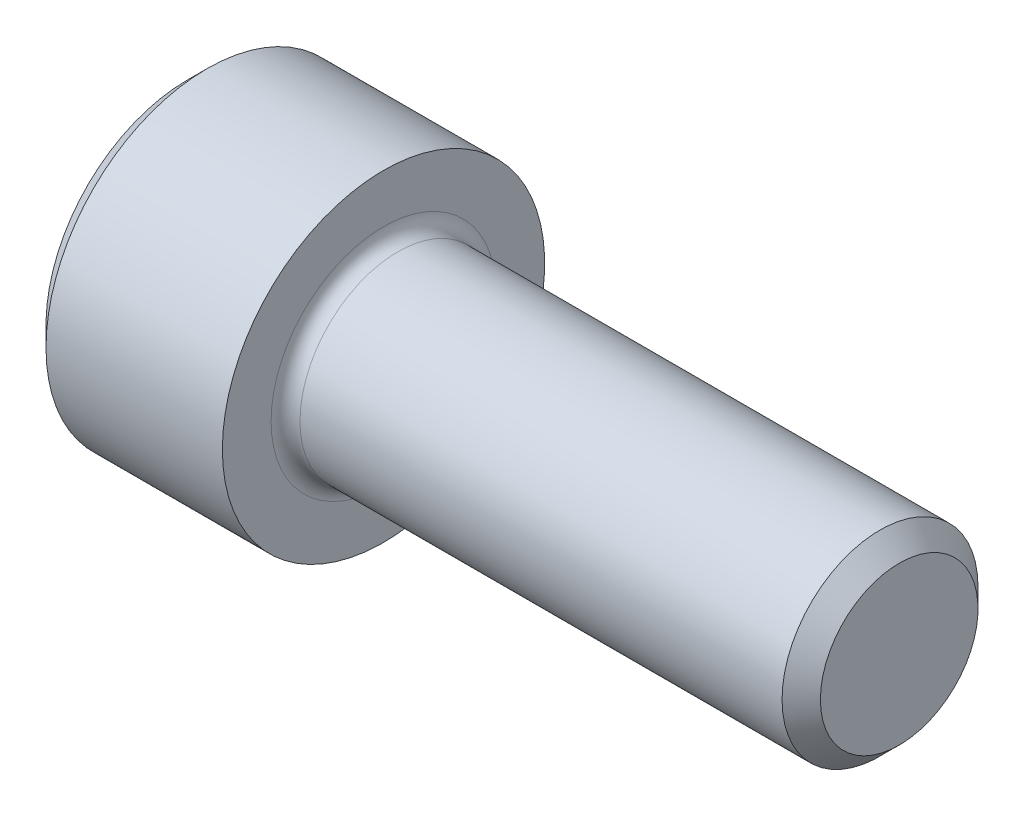
ISO-10303-21;
HEADER;
FILE_DESCRIPTION(('STEP AP214'),'2;1');
FILE_NAME('part.step','',(''),(''),'','','');
FILE_SCHEMA(('AUTOMOTIVE_DESIGN { 1 0 10303 214 1 1 1 1 }'));
ENDSEC;
DATA;
#1=APPLICATION_CONTEXT('core data for automotive mechanical design processes');
#2=APPLICATION_PROTOCOL_DEFINITION('international standard','automotive_design',2000,#1);
#3=PRODUCT_CONTEXT('',#1,'mechanical');
#4=PRODUCT('Part','Part','',(#3));
#5=PRODUCT_RELATED_PRODUCT_CATEGORY('part','',(#4));
#6=PRODUCT_DEFINITION_FORMATION('','',#4);
#7=PRODUCT_DEFINITION_CONTEXT('part definition',#1,'design');
#8=PRODUCT_DEFINITION('design','',#6,#7);
#9=PRODUCT_DEFINITION_SHAPE('','',#8);
#10=(LENGTH_UNIT() NAMED_UNIT(*) SI_UNIT(.MILLI.,.METRE.));
#11=(NAMED_UNIT(*) PLANE_ANGLE_UNIT() SI_UNIT($,.RADIAN.));
#12=(NAMED_UNIT(*) SI_UNIT($,.STERADIAN.) SOLID_ANGLE_UNIT());
#13=UNCERTAINTY_MEASURE_WITH_UNIT(LENGTH_MEASURE(1.E-05),#10,'distance_accuracy_value','');
#14=(GEOMETRIC_REPRESENTATION_CONTEXT(3) GLOBAL_UNCERTAINTY_ASSIGNED_CONTEXT((#13)) GLOBAL_UNIT_ASSIGNED_CONTEXT((#10,
#11,#12)) REPRESENTATION_CONTEXT('',''));
#15=CARTESIAN_POINT('',(0.,0.,0.));
#16=DIRECTION('',(0.,0.,1.));
#17=DIRECTION('',(1.,0.,0.));
#18=AXIS2_PLACEMENT_3D('',#15,#16,#17);
#19=CARTESIAN_POINT('',(2.286,1.14604605784411,1.98501));
#20=DIRECTION('',(-1.,0.,0.));
#21=DIRECTION('',(0.,0.,1.));
#22=AXIS2_PLACEMENT_3D('',#19,#20,#21);
#23=PLANE('',#22);
#24=DIRECTION('',(0.,0.500000000000001,0.866025403784438));
#25=VECTOR('',#24,1.);
#26=CARTESIAN_POINT('',(2.286,-1.71906908676614,0.992505));
#27=LINE('',#26,#25);
#28=CARTESIAN_POINT('',(2.2859999999804,-1.71906908679011,0.992505000013839));
#29=VERTEX_POINT('',#28);
#30=CARTESIAN_POINT('',(2.286,-1.14604605784409,1.98501));
#31=VERTEX_POINT('',#30);
#32=EDGE_CURVE('E101',#29,#31,#27,.T.);
#33=ORIENTED_EDGE('',*,*,#32,.T.);
#34=DIRECTION('',(0.,1.,0.));
#35=VECTOR('',#34,1.);
#36=CARTESIAN_POINT('',(2.286,1.14604605784411,1.98501));
#37=LINE('',#36,#35);
#38=CARTESIAN_POINT('',(2.28599999998701,0.,1.98501000001309));
#39=VERTEX_POINT('',#38);
#40=EDGE_CURVE('E96',#31,#39,#37,.T.);
#41=ORIENTED_EDGE('',*,*,#40,.T.);
#42=CARTESIAN_POINT('',(2.2859999999608,0.,0.));
#43=DIRECTION('',(-1.,0.,0.));
#44=DIRECTION('',(0.,0.,1.));
#45=AXIS2_PLACEMENT_3D('',#42,#43,#44);
#46=CIRCLE('',#45,1.98501000005535);
#47=EDGE_CURVE('E98',#39,#29,#46,.F.);
#48=ORIENTED_EDGE('',*,*,#47,.T.);
#49=EDGE_LOOP('',(#33,#41,#48));
#50=FACE_BOUND('',#49,.T.);
#51=ADVANCED_FACE('F17',(#50),#23,.T.);
#52=CARTESIAN_POINT('',(2.286,1.14604605784411,1.98501));
#53=DIRECTION('',(-1.,0.,0.));
#54=DIRECTION('',(0.,0.,1.));
#55=AXIS2_PLACEMENT_3D('',#52,#53,#54);
#56=PLANE('',#55);
#57=DIRECTION('',(0.,-0.499999999999998,0.86602540378444));
#58=VECTOR('',#57,1.);
#59=CARTESIAN_POINT('',(2.286,-1.71906908676615,-0.992504999999996));
#60=LINE('',#59,#58);
#61=CARTESIAN_POINT('',(2.2859999999804,-1.71906908679012,-0.992505000013836));
#62=VERTEX_POINT('',#61);
#63=CARTESIAN_POINT('',(2.286,-2.29209211568819,0.));
#64=VERTEX_POINT('',#63);
#65=EDGE_CURVE('E105',#62,#64,#60,.T.);
#66=ORIENTED_EDGE('',*,*,#65,.T.);
#67=DIRECTION('',(0.,0.500000000000001,0.866025403784438));
#68=VECTOR('',#67,1.);
#69=CARTESIAN_POINT('',(2.286,-2.29209211568819,0.));
#70=LINE('',#69,#68);
#71=EDGE_CURVE('E172',#64,#29,#70,.T.);
#72=ORIENTED_EDGE('',*,*,#71,.T.);
#73=CARTESIAN_POINT('',(2.2859999999608,0.,0.));
#74=DIRECTION('',(-1.,0.,0.));
#75=DIRECTION('',(0.,0.,1.));
#76=AXIS2_PLACEMENT_3D('',#73,#74,#75);
#77=CIRCLE('',#76,1.98501000005535);
#78=EDGE_CURVE('E117',#29,#62,#77,.F.);
#79=ORIENTED_EDGE('',*,*,#78,.T.);
#80=EDGE_LOOP('',(#66,#72,#79));
#81=FACE_BOUND('',#80,.T.);
#82=ADVANCED_FACE('F348',(#81),#56,.T.);
#83=CARTESIAN_POINT('',(2.286,1.14604605784411,1.98501));
#84=DIRECTION('',(-1.,0.,0.));
#85=DIRECTION('',(0.,0.,1.));
#86=AXIS2_PLACEMENT_3D('',#83,#84,#85);
#87=PLANE('',#86);
#88=DIRECTION('',(0.,1.,0.));
#89=VECTOR('',#88,1.);
#90=CARTESIAN_POINT('',(2.286,1.14604605784411,-1.98501));
#91=LINE('',#90,#89);
#92=CARTESIAN_POINT('',(2.28599999998701,0.,-1.98501000001309));
#93=VERTEX_POINT('',#92);
#94=CARTESIAN_POINT('',(2.286,-1.1460460578441,-1.98501));
#95=VERTEX_POINT('',#94);
#96=EDGE_CURVE('E167',#93,#95,#91,.F.);
#97=ORIENTED_EDGE('',*,*,#96,.T.);
#98=DIRECTION('',(0.,-0.499999999999999,0.866025403784439));
#99=VECTOR('',#98,1.);
#100=CARTESIAN_POINT('',(2.286,-1.1460460578441,-1.98501));
#101=LINE('',#100,#99);
#102=EDGE_CURVE('E162',#95,#62,#101,.T.);
#103=ORIENTED_EDGE('',*,*,#102,.T.);
#104=CARTESIAN_POINT('',(2.2859999999608,0.,0.));
#105=DIRECTION('',(-1.,0.,0.));
#106=DIRECTION('',(0.,0.,1.));
#107=AXIS2_PLACEMENT_3D('',#104,#105,#106);
#108=CIRCLE('',#107,1.98501000005535);
#109=EDGE_CURVE('E225',#62,#93,#108,.F.);
#110=ORIENTED_EDGE('',*,*,#109,.T.);
#111=EDGE_LOOP('',(#97,#103,#110));
#112=FACE_BOUND('',#111,.T.);
#113=ADVANCED_FACE('F345',(#112),#87,.T.);
#114=CARTESIAN_POINT('',(2.286,1.14604605784411,1.98501));
#115=DIRECTION('',(-1.,0.,0.));
#116=DIRECTION('',(0.,0.,1.));
#117=AXIS2_PLACEMENT_3D('',#114,#115,#116);
#118=PLANE('',#117);
#119=DIRECTION('',(0.,-0.500000000000001,-0.866025403784438));
#120=VECTOR('',#119,1.);
#121=CARTESIAN_POINT('',(2.286,1.71906908676615,-0.992505000000006));
#122=LINE('',#121,#120);
#123=CARTESIAN_POINT('',(2.2859999999804,1.71906908679012,-0.992505000013843));
#124=VERTEX_POINT('',#123);
#125=CARTESIAN_POINT('',(2.286,1.1460460578441,-1.98501));
#126=VERTEX_POINT('',#125);
#127=EDGE_CURVE('E157',#124,#126,#122,.T.);
#128=ORIENTED_EDGE('',*,*,#127,.T.);
#129=DIRECTION('',(0.,1.,0.));
#130=VECTOR('',#129,1.);
#131=CARTESIAN_POINT('',(2.286,1.14604605784411,-1.98501));
#132=LINE('',#131,#130);
#133=EDGE_CURVE('E152',#126,#93,#132,.F.);
#134=ORIENTED_EDGE('',*,*,#133,.T.);
#135=CARTESIAN_POINT('',(2.2859999999608,0.,0.));
#136=DIRECTION('',(-1.,0.,0.));
#137=DIRECTION('',(0.,0.,1.));
#138=AXIS2_PLACEMENT_3D('',#135,#136,#137);
#139=CIRCLE('',#138,1.98501000005535);
#140=EDGE_CURVE('E222',#93,#124,#139,.F.);
#141=ORIENTED_EDGE('',*,*,#140,.T.);
#142=EDGE_LOOP('',(#128,#134,#141));
#143=FACE_BOUND('',#142,.T.);
#144=ADVANCED_FACE('F341',(#143),#118,.T.);
#145=CARTESIAN_POINT('',(2.286,1.14604605784411,1.98501));
#146=DIRECTION('',(-1.,0.,0.));
#147=DIRECTION('',(0.,0.,1.));
#148=AXIS2_PLACEMENT_3D('',#145,#146,#147);
#149=PLANE('',#148);
#150=DIRECTION('',(0.,0.500000000000002,-0.866025403784437));
#151=VECTOR('',#150,1.);
#152=CARTESIAN_POINT('',(2.286,1.71906908676615,0.992504999999996));
#153=LINE('',#152,#151);
#154=CARTESIAN_POINT('',(2.2859999999804,1.71906908679012,0.992505000013835));
#155=VERTEX_POINT('',#154);
#156=CARTESIAN_POINT('',(2.286,2.2920921156882,0.));
#157=VERTEX_POINT('',#156);
#158=EDGE_CURVE('E147',#155,#157,#153,.T.);
#159=ORIENTED_EDGE('',*,*,#158,.T.);
#160=DIRECTION('',(0.,-0.500000000000002,-0.866025403784437));
#161=VECTOR('',#160,1.);
#162=CARTESIAN_POINT('',(2.286,2.2920921156882,0.));
#163=LINE('',#162,#161);
#164=EDGE_CURVE('E118',#157,#124,#163,.T.);
#165=ORIENTED_EDGE('',*,*,#164,.T.);
#166=CARTESIAN_POINT('',(2.2859999999608,0.,0.));
#167=DIRECTION('',(-1.,0.,0.));
#168=DIRECTION('',(0.,0.,1.));
#169=AXIS2_PLACEMENT_3D('',#166,#167,#168);
#170=CIRCLE('',#169,1.98501000005535);
#171=EDGE_CURVE('E125',#124,#155,#170,.F.);
#172=ORIENTED_EDGE('',*,*,#171,.T.);
#173=EDGE_LOOP('',(#159,#165,#172));
#174=FACE_BOUND('',#173,.T.);
#175=ADVANCED_FACE('F337',(#174),#149,.T.);
#176=CARTESIAN_POINT('',(2.28600000002643,0.,0.));
#177=DIRECTION('',(-1.,0.,0.));
#178=DIRECTION('',(0.,0.,1.));
#179=AXIS2_PLACEMENT_3D('',#176,#177,#178);
#180=CONICAL_SURFACE('',#179,1.98500999994167,1.04719755112655);
#181=CARTESIAN_POINT('',(3.43204605781011,0.,5.6843418860808E-11));
#182=VERTEX_POINT('',#181);
#183=VERTEX_LOOP('',#182);
#184=FACE_BOUND('',#183,.T.);
#185=ORIENTED_EDGE('',*,*,#47,.F.);
#186=CARTESIAN_POINT('',(2.2859999999608,0.,0.));
#187=DIRECTION('',(-1.,0.,0.));
#188=DIRECTION('',(0.,0.,1.));
#189=AXIS2_PLACEMENT_3D('',#186,#187,#188);
#190=CIRCLE('',#189,1.98501000005535);
#191=EDGE_CURVE('E113',#155,#39,#190,.F.);
#192=ORIENTED_EDGE('',*,*,#191,.F.);
#193=ORIENTED_EDGE('',*,*,#171,.F.);
#194=ORIENTED_EDGE('',*,*,#140,.F.);
#195=ORIENTED_EDGE('',*,*,#109,.F.);
#196=ORIENTED_EDGE('',*,*,#78,.F.);
#197=EDGE_LOOP('',(#185,#192,#193,#194,#195,#196));
#198=FACE_BOUND('',#197,.T.);
#199=ADVANCED_FACE('F111',(#184,#198),#180,.F.);
#200=CARTESIAN_POINT('',(2.286,1.14604605784411,1.98501));
#201=DIRECTION('',(-1.,0.,0.));
#202=DIRECTION('',(0.,0.,1.));
#203=AXIS2_PLACEMENT_3D('',#200,#201,#202);
#204=PLANE('',#203);
#205=DIRECTION('',(0.,-1.,0.));
#206=VECTOR('',#205,1.);
#207=CARTESIAN_POINT('',(2.286,-1.14604605784409,1.98501));
#208=LINE('',#207,#206);
#209=CARTESIAN_POINT('',(2.286,1.14604605784411,1.98501));
#210=VERTEX_POINT('',#209);
#211=EDGE_CURVE('E122',#39,#210,#208,.F.);
#212=ORIENTED_EDGE('',*,*,#211,.T.);
#213=DIRECTION('',(0.,0.499999999999998,-0.86602540378444));
#214=VECTOR('',#213,1.);
#215=CARTESIAN_POINT('',(2.286,2.2920921156882,0.));
#216=LINE('',#215,#214);
#217=EDGE_CURVE('E124',#155,#210,#216,.F.);
#218=ORIENTED_EDGE('',*,*,#217,.F.);
#219=ORIENTED_EDGE('',*,*,#191,.T.);
#220=EDGE_LOOP('',(#212,#218,#219));
#221=FACE_BOUND('',#220,.T.);
#222=ADVANCED_FACE('F121',(#221),#204,.T.);
#223=CARTESIAN_POINT('',(2.286,2.2920921156882,0.));
#224=DIRECTION('',(0.,-0.86602540378444,-0.499999999999998));
#225=DIRECTION('',(0.,0.499999999999998,-0.86602540378444));
#226=AXIS2_PLACEMENT_3D('',#223,#224,#225);
#227=PLANE('',#226);
#228=ORIENTED_EDGE('',*,*,#217,.T.);
#229=DIRECTION('',(1.,0.,0.));
#230=VECTOR('',#229,1.);
#231=CARTESIAN_POINT('',(2.286,1.14604605784411,1.98501));
#232=LINE('',#231,#230);
#233=CARTESIAN_POINT('',(0.,1.14604605784411,1.98501));
#234=VERTEX_POINT('',#233);
#235=EDGE_CURVE('E130',#210,#234,#232,.F.);
#236=ORIENTED_EDGE('',*,*,#235,.T.);
#237=DIRECTION('',(0.,-0.499999999999998,0.86602540378444));
#238=VECTOR('',#237,1.);
#239=CARTESIAN_POINT('',(0.,2.2920921156882,0.));
#240=LINE('',#239,#238);
#241=CARTESIAN_POINT('',(0.,2.2920921156882,0.));
#242=VERTEX_POINT('',#241);
#243=EDGE_CURVE('E137',#242,#234,#240,.T.);
#244=ORIENTED_EDGE('',*,*,#243,.F.);
#245=DIRECTION('',(1.,0.,0.));
#246=VECTOR('',#245,1.);
#247=CARTESIAN_POINT('',(2.286,2.2920921156882,0.));
#248=LINE('',#247,#246);
#249=EDGE_CURVE('E187',#242,#157,#248,.T.);
#250=ORIENTED_EDGE('',*,*,#249,.T.);
#251=ORIENTED_EDGE('',*,*,#158,.F.);
#252=EDGE_LOOP('',(#228,#236,#244,#250,#251));
#253=FACE_BOUND('',#252,.T.);
#254=ADVANCED_FACE('F329',(#253),#227,.T.);
#255=CARTESIAN_POINT('',(2.286,-1.14604605784409,1.98501));
#256=DIRECTION('',(0.,0.,1.));
#257=DIRECTION('',(0.,-1.,0.));
#258=AXIS2_PLACEMENT_3D('',#255,#256,#257);
#259=PLANE('',#258);
#260=ORIENTED_EDGE('',*,*,#235,.F.);
#261=ORIENTED_EDGE('',*,*,#211,.F.);
#262=ORIENTED_EDGE('',*,*,#40,.F.);
#263=DIRECTION('',(1.,0.,0.));
#264=VECTOR('',#263,1.);
#265=CARTESIAN_POINT('',(2.286,-1.14604605784409,1.98501));
#266=LINE('',#265,#264);
#267=CARTESIAN_POINT('',(0.,-1.14604605784409,1.98501));
#268=VERTEX_POINT('',#267);
#269=EDGE_CURVE('E132',#268,#31,#266,.T.);
#270=ORIENTED_EDGE('',*,*,#269,.F.);
#271=DIRECTION('',(0.,1.,0.));
#272=VECTOR('',#271,1.);
#273=CARTESIAN_POINT('',(0.,0.,1.98501));
#274=LINE('',#273,#272);
#275=EDGE_CURVE('E363',#234,#268,#274,.F.);
#276=ORIENTED_EDGE('',*,*,#275,.F.);
#277=EDGE_LOOP('',(#260,#261,#262,#270,#276));
#278=FACE_BOUND('',#277,.T.);
#279=ADVANCED_FACE('F128',(#278),#259,.F.);
#280=CARTESIAN_POINT('',(2.286,-1.14604605784409,1.98501));
#281=DIRECTION('',(0.,0.866025403784438,-0.500000000000001));
#282=DIRECTION('',(0.,0.500000000000001,0.866025403784438));
#283=AXIS2_PLACEMENT_3D('',#280,#281,#282);
#284=PLANE('',#283);
#285=ORIENTED_EDGE('',*,*,#71,.F.);
#286=DIRECTION('',(1.,0.,0.));
#287=VECTOR('',#286,1.);
#288=CARTESIAN_POINT('',(2.286,-2.29209211568819,0.));
#289=LINE('',#288,#287);
#290=CARTESIAN_POINT('',(0.,-2.29209211568819,0.));
#291=VERTEX_POINT('',#290);
#292=EDGE_CURVE('E198',#291,#64,#289,.T.);
#293=ORIENTED_EDGE('',*,*,#292,.F.);
#294=DIRECTION('',(0.,-0.500000000000001,-0.866025403784438));
#295=VECTOR('',#294,1.);
#296=CARTESIAN_POINT('',(0.,-1.14604605784409,1.98501));
#297=LINE('',#296,#295);
#298=EDGE_CURVE('E361',#268,#291,#297,.T.);
#299=ORIENTED_EDGE('',*,*,#298,.F.);
#300=ORIENTED_EDGE('',*,*,#269,.T.);
#301=ORIENTED_EDGE('',*,*,#32,.F.);
#302=EDGE_LOOP('',(#285,#293,#299,#300,#301));
#303=FACE_BOUND('',#302,.T.);
#304=ADVANCED_FACE('F322',(#303),#284,.T.);
#305=CARTESIAN_POINT('',(2.286,-2.29209211568819,0.));
#306=DIRECTION('',(0.,0.866025403784439,0.499999999999999));
#307=DIRECTION('',(0.,-0.499999999999999,0.866025403784439));
#308=AXIS2_PLACEMENT_3D('',#305,#306,#307);
#309=PLANE('',#308);
#310=ORIENTED_EDGE('',*,*,#102,.F.);
#311=DIRECTION('',(1.,0.,0.));
#312=VECTOR('',#311,1.);
#313=CARTESIAN_POINT('',(2.286,-1.1460460578441,-1.98501));
#314=LINE('',#313,#312);
#315=CARTESIAN_POINT('',(0.,-1.1460460578441,-1.98501));
#316=VERTEX_POINT('',#315);
#317=EDGE_CURVE('E191',#95,#316,#314,.F.);
#318=ORIENTED_EDGE('',*,*,#317,.T.);
#319=DIRECTION('',(0.,0.499999999999999,-0.86602540378444));
#320=VECTOR('',#319,1.);
#321=CARTESIAN_POINT('',(0.,-2.29209211568819,0.));
#322=LINE('',#321,#320);
#323=EDGE_CURVE('E358',#291,#316,#322,.T.);
#324=ORIENTED_EDGE('',*,*,#323,.F.);
#325=ORIENTED_EDGE('',*,*,#292,.T.);
#326=ORIENTED_EDGE('',*,*,#65,.F.);
#327=EDGE_LOOP('',(#310,#318,#324,#325,#326));
#328=FACE_BOUND('',#327,.T.);
#329=ADVANCED_FACE('F318',(#328),#309,.T.);
#330=CARTESIAN_POINT('',(2.286,1.1460460578441,-1.98501));
#331=DIRECTION('',(0.,0.,-1.));
#332=DIRECTION('',(0.,1.,0.));
#333=AXIS2_PLACEMENT_3D('',#330,#331,#332);
#334=PLANE('',#333);
#335=ORIENTED_EDGE('',*,*,#317,.F.);
#336=ORIENTED_EDGE('',*,*,#96,.F.);
#337=ORIENTED_EDGE('',*,*,#133,.F.);
#338=DIRECTION('',(1.,0.,0.));
#339=VECTOR('',#338,1.);
#340=CARTESIAN_POINT('',(2.286,1.1460460578441,-1.98501));
#341=LINE('',#340,#339);
#342=CARTESIAN_POINT('',(0.,1.1460460578441,-1.98501));
#343=VERTEX_POINT('',#342);
#344=EDGE_CURVE('E190',#126,#343,#341,.F.);
#345=ORIENTED_EDGE('',*,*,#344,.T.);
#346=DIRECTION('',(0.,1.,0.));
#347=VECTOR('',#346,1.);
#348=CARTESIAN_POINT('',(0.,0.,-1.98501));
#349=LINE('',#348,#347);
#350=EDGE_CURVE('E373',#316,#343,#349,.T.);
#351=ORIENTED_EDGE('',*,*,#350,.F.);
#352=EDGE_LOOP('',(#335,#336,#337,#345,#351));
#353=FACE_BOUND('',#352,.T.);
#354=ADVANCED_FACE('F314',(#353),#334,.F.);
#355=CARTESIAN_POINT('',(2.286,2.2920921156882,0.));
#356=DIRECTION('',(0.,0.866025403784438,-0.500000000000002));
#357=DIRECTION('',(0.,0.500000000000002,0.866025403784438));
#358=AXIS2_PLACEMENT_3D('',#355,#356,#357);
#359=PLANE('',#358);
#360=ORIENTED_EDGE('',*,*,#344,.F.);
#361=ORIENTED_EDGE('',*,*,#127,.F.);
#362=ORIENTED_EDGE('',*,*,#164,.F.);
#363=ORIENTED_EDGE('',*,*,#249,.F.);
#364=DIRECTION('',(0.,0.500000000000002,0.866025403784438));
#365=VECTOR('',#364,1.);
#366=CARTESIAN_POINT('',(0.,1.1460460578441,-1.98501));
#367=LINE('',#366,#365);
#368=EDGE_CURVE('E218',#343,#242,#367,.T.);
#369=ORIENTED_EDGE('',*,*,#368,.F.);
#370=EDGE_LOOP('',(#360,#361,#362,#363,#369));
#371=FACE_BOUND('',#370,.T.);
#372=ADVANCED_FACE('F310',(#371),#359,.F.);
#373=CARTESIAN_POINT('',(0.,0.,0.));
#374=DIRECTION('',(-1.,0.,0.));
#375=DIRECTION('',(0.,0.,1.));
#376=AXIS2_PLACEMENT_3D('',#373,#374,#375);
#377=PLANE('',#376);
#378=CARTESIAN_POINT('',(-5.6843418860808E-11,0.,0.));
#379=DIRECTION('',(1.,0.,0.));
#380=DIRECTION('',(0.,1.,0.));
#381=AXIS2_PLACEMENT_3D('',#378,#379,#380);
#382=CIRCLE('',#381,3.48615000001473);
#383=CARTESIAN_POINT('',(-5.68434426698877E-11,3.48615000001473,0.));
#384=VERTEX_POINT('',#383);
#385=EDGE_CURVE('E216',#384,#384,#382,.T.);
#386=ORIENTED_EDGE('',*,*,#385,.F.);
#387=EDGE_LOOP('',(#386));
#388=FACE_BOUND('',#387,.T.);
#389=ORIENTED_EDGE('',*,*,#350,.T.);
#390=ORIENTED_EDGE('',*,*,#368,.T.);
#391=ORIENTED_EDGE('',*,*,#243,.T.);
#392=ORIENTED_EDGE('',*,*,#275,.T.);
#393=ORIENTED_EDGE('',*,*,#298,.T.);
#394=ORIENTED_EDGE('',*,*,#323,.T.);
#395=EDGE_LOOP('',(#389,#390,#391,#392,#393,#394));
#396=FACE_BOUND('',#395,.T.);
#397=ADVANCED_FACE('F302',(#388,#396),#377,.T.);
#398=CARTESIAN_POINT('',(0.482599999998001,0.,0.));
#399=DIRECTION('',(1.,0.,0.));
#400=DIRECTION('',(0.,1.,0.));
#401=AXIS2_PLACEMENT_3D('',#398,#399,#400);
#402=CONICAL_SURFACE('',#401,3.96875000006958,0.785398163397448);
#403=ORIENTED_EDGE('',*,*,#385,.T.);
#404=EDGE_LOOP('',(#403));
#405=FACE_BOUND('',#404,.T.);
#406=CARTESIAN_POINT('',(0.4826,0.,0.));
#407=DIRECTION('',(-1.,0.,0.));
#408=DIRECTION('',(0.,0.,1.));
#409=AXIS2_PLACEMENT_3D('',#406,#407,#408);
#410=CIRCLE('',#409,3.96875);
#411=CARTESIAN_POINT('',(0.4826,0.,3.96875));
#412=VERTEX_POINT('',#411);
#413=EDGE_CURVE('E215',#412,#412,#410,.F.);
#414=ORIENTED_EDGE('',*,*,#413,.F.);
#415=EDGE_LOOP('',(#414));
#416=FACE_BOUND('',#415,.T.);
#417=ADVANCED_FACE('F297',(#405,#416),#402,.T.);
#418=CARTESIAN_POINT('',(-31.75,0.,0.));
#419=DIRECTION('',(-1.,0.,0.));
#420=DIRECTION('',(0.,0.,1.));
#421=AXIS2_PLACEMENT_3D('',#418,#419,#420);
#422=CYLINDRICAL_SURFACE('',#421,3.96875);
#423=CARTESIAN_POINT('',(4.826,0.,0.));
#424=DIRECTION('',(-1.,0.,0.));
#425=DIRECTION('',(0.,0.,1.));
#426=AXIS2_PLACEMENT_3D('',#423,#424,#425);
#427=CIRCLE('',#426,3.96875);
#428=CARTESIAN_POINT('',(4.826,0.,3.96875));
#429=VERTEX_POINT('',#428);
#430=EDGE_CURVE('E212',#429,#429,#427,.F.);
#431=ORIENTED_EDGE('',*,*,#430,.F.);
#432=EDGE_LOOP('',(#431));
#433=FACE_BOUND('',#432,.T.);
#434=ORIENTED_EDGE('',*,*,#413,.T.);
#435=EDGE_LOOP('',(#434));
#436=FACE_BOUND('',#435,.T.);
#437=ADVANCED_FACE('F293',(#433,#436),#422,.T.);
#438=CARTESIAN_POINT('',(17.526,1.94056,0.));
#439=DIRECTION('',(1.,0.,0.));
#440=DIRECTION('',(0.,0.,-1.));
#441=AXIS2_PLACEMENT_3D('',#438,#439,#440);
#442=PLANE('',#441);
#443=CARTESIAN_POINT('',(17.5259999999753,0.,0.));
#444=DIRECTION('',(-1.,0.,0.));
#445=DIRECTION('',(0.,0.,1.));
#446=AXIS2_PLACEMENT_3D('',#443,#444,#445);
#447=CIRCLE('',#446,1.94055999998);
#448=CARTESIAN_POINT('',(17.5259999999753,0.,1.94055999998));
#449=VERTEX_POINT('',#448);
#450=EDGE_CURVE('E208',#449,#449,#447,.T.);
#451=ORIENTED_EDGE('',*,*,#450,.F.);
#452=EDGE_LOOP('',(#451));
#453=FACE_BOUND('',#452,.T.);
#454=ADVANCED_FACE('F251',(#453),#442,.T.);
#455=CARTESIAN_POINT('',(4.826,3.96875,0.));
#456=DIRECTION('',(1.,0.,0.));
#457=DIRECTION('',(0.,0.,-1.));
#458=AXIS2_PLACEMENT_3D('',#455,#456,#457);
#459=PLANE('',#458);
#460=ORIENTED_EDGE('',*,*,#430,.T.);
#461=EDGE_LOOP('',(#460));
#462=FACE_BOUND('',#461,.T.);
#463=CARTESIAN_POINT('',(4.826,0.,0.));
#464=DIRECTION('',(1.,0.,0.));
#465=DIRECTION('',(0.,0.,1.));
#466=AXIS2_PLACEMENT_3D('',#463,#464,#465);
#467=CIRCLE('',#466,2.76859999999999);
#468=CARTESIAN_POINT('',(4.826,0.,-2.76859999999999));
#469=VERTEX_POINT('',#468);
#470=CARTESIAN_POINT('',(4.826,0.,2.76859999999999));
#471=VERTEX_POINT('',#470);
#472=EDGE_CURVE('E211',#469,#471,#467,.F.);
#473=ORIENTED_EDGE('',*,*,#472,.T.);
#474=CARTESIAN_POINT('',(4.826,0.,0.));
#475=DIRECTION('',(1.,0.,0.));
#476=DIRECTION('',(0.,0.,-1.));
#477=AXIS2_PLACEMENT_3D('',#474,#475,#476);
#478=CIRCLE('',#477,2.76859999999999);
#479=EDGE_CURVE('E36',#471,#469,#478,.F.);
#480=ORIENTED_EDGE('',*,*,#479,.T.);
#481=EDGE_LOOP('',(#473,#480));
#482=FACE_BOUND('',#481,.T.);
#483=ADVANCED_FACE('F232',(#462,#482),#459,.T.);
#484=CARTESIAN_POINT('',(17.0535599999084,0.,0.));
#485=DIRECTION('',(-1.,0.,0.));
#486=DIRECTION('',(0.,0.,1.));
#487=AXIS2_PLACEMENT_3D('',#484,#485,#486);
#488=CONICAL_SURFACE('',#487,2.41299999999001,0.785398163337289);
#489=CARTESIAN_POINT('',(17.05356,0.,0.));
#490=DIRECTION('',(-1.,0.,0.));
#491=DIRECTION('',(0.,0.,1.));
#492=AXIS2_PLACEMENT_3D('',#489,#490,#491);
#493=CIRCLE('',#492,2.41299999999999);
#494=CARTESIAN_POINT('',(17.05356,0.,2.41299999999999));
#495=VERTEX_POINT('',#494);
#496=EDGE_CURVE('E28',#495,#495,#493,.T.);
#497=ORIENTED_EDGE('',*,*,#496,.F.);
#498=EDGE_LOOP('',(#497));
#499=FACE_BOUND('',#498,.T.);
#500=ORIENTED_EDGE('',*,*,#450,.T.);
#501=EDGE_LOOP('',(#500));
#502=FACE_BOUND('',#501,.T.);
#503=ADVANCED_FACE('F250',(#499,#502),#488,.T.);
#504=CARTESIAN_POINT('',(5.1816,0.,0.));
#505=DIRECTION('',(1.,0.,0.));
#506=DIRECTION('',(0.,0.,-1.));
#507=AXIS2_PLACEMENT_3D('',#504,#505,#506);
#508=TOROIDAL_SURFACE('',#507,2.76859999999999,0.3556);
#509=CARTESIAN_POINT('',(5.1816,0.,0.));
#510=DIRECTION('',(-1.,0.,0.));
#511=DIRECTION('',(0.,0.,1.));
#512=AXIS2_PLACEMENT_3D('',#509,#510,#511);
#513=CIRCLE('',#512,2.41299999999999);
#514=CARTESIAN_POINT('',(5.1816,0.,2.41299999999999));
#515=VERTEX_POINT('',#514);
#516=EDGE_CURVE('E11',#515,#515,#513,.F.);
#517=ORIENTED_EDGE('',*,*,#516,.F.);
#518=EDGE_LOOP('',(#517));
#519=FACE_BOUND('',#518,.T.);
#520=ORIENTED_EDGE('',*,*,#472,.F.);
#521=ORIENTED_EDGE('',*,*,#479,.F.);
#522=EDGE_LOOP('',(#520,#521));
#523=FACE_BOUND('',#522,.T.);
#524=ADVANCED_FACE('F229',(#519,#523),#508,.F.);
#525=CARTESIAN_POINT('',(-31.75,0.,0.));
#526=DIRECTION('',(-1.,0.,0.));
#527=DIRECTION('',(0.,0.,1.));
#528=AXIS2_PLACEMENT_3D('',#525,#526,#527);
#529=CYLINDRICAL_SURFACE('',#528,2.41299999999999);
#530=ORIENTED_EDGE('',*,*,#516,.T.);
#531=EDGE_LOOP('',(#530));
#532=FACE_BOUND('',#531,.T.);
#533=ORIENTED_EDGE('',*,*,#496,.T.);
#534=EDGE_LOOP('',(#533));
#535=FACE_BOUND('',#534,.T.);
#536=ADVANCED_FACE('F275',(#532,#535),#529,.T.);
#537=CLOSED_SHELL('',(#51,#82,#113,#144,#175,#199,#222,#254,#279,#304,#329,#354,#372,#397,#417,
#437,#454,#483,#503,#524,#536));
#538=MANIFOLD_SOLID_BREP('B1',#537);
#539=ADVANCED_BREP_SHAPE_REPRESENTATION('',(#18,#538),#14);
#540=SHAPE_DEFINITION_REPRESENTATION(#9,#539);
ENDSEC;
END-ISO-10303-21;
